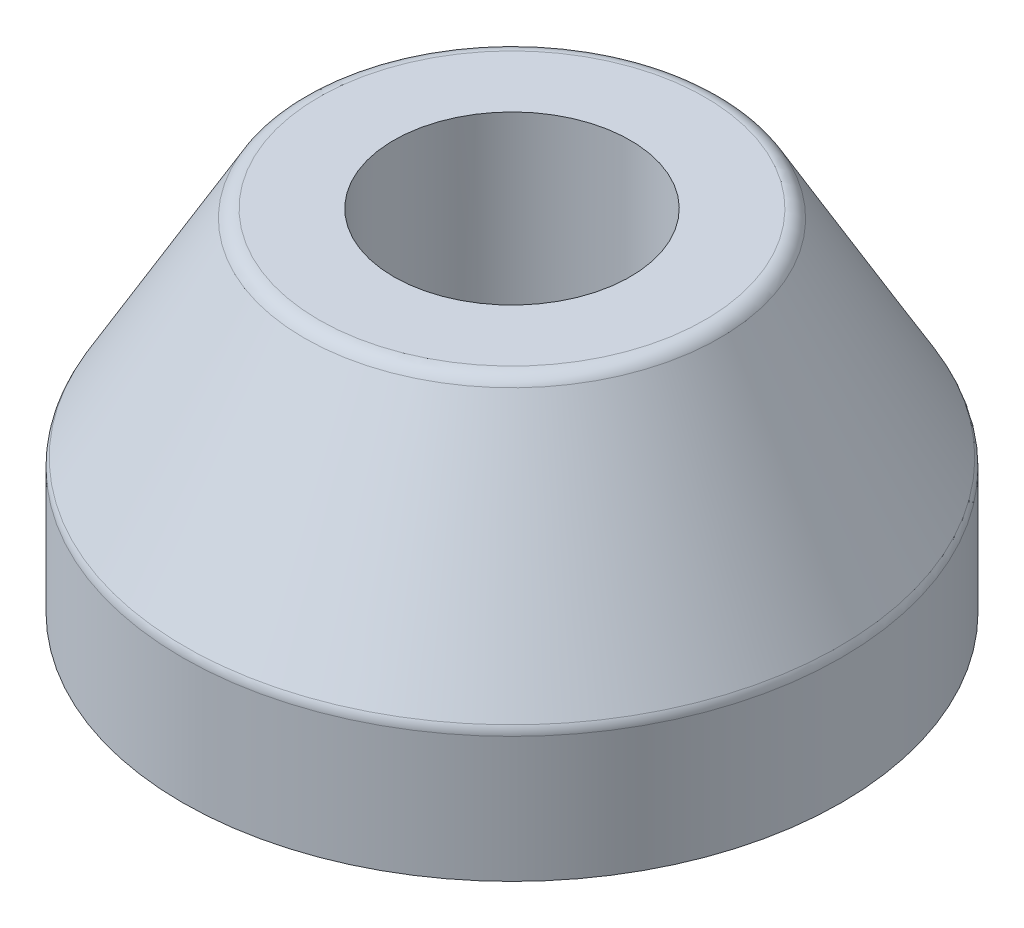
ISO-10303-21;
HEADER;
FILE_DESCRIPTION(('STEP AP214'),'2;1');
FILE_NAME('part.step','',(''),(''),'','','');
FILE_SCHEMA(('AUTOMOTIVE_DESIGN { 1 0 10303 214 1 1 1 1 }'));
ENDSEC;
DATA;
#1=APPLICATION_CONTEXT('core data for automotive mechanical design processes');
#2=APPLICATION_PROTOCOL_DEFINITION('international standard','automotive_design',2000,#1);
#3=PRODUCT_CONTEXT('',#1,'mechanical');
#4=PRODUCT('Part','Part','',(#3));
#5=PRODUCT_RELATED_PRODUCT_CATEGORY('part','',(#4));
#6=PRODUCT_DEFINITION_FORMATION('','',#4);
#7=PRODUCT_DEFINITION_CONTEXT('part definition',#1,'design');
#8=PRODUCT_DEFINITION('design','',#6,#7);
#9=PRODUCT_DEFINITION_SHAPE('','',#8);
#10=(LENGTH_UNIT() NAMED_UNIT(*) SI_UNIT(.MILLI.,.METRE.));
#11=(NAMED_UNIT(*) PLANE_ANGLE_UNIT() SI_UNIT($,.RADIAN.));
#12=(NAMED_UNIT(*) SI_UNIT($,.STERADIAN.) SOLID_ANGLE_UNIT());
#13=UNCERTAINTY_MEASURE_WITH_UNIT(LENGTH_MEASURE(1.E-05),#10,'distance_accuracy_value','');
#14=(GEOMETRIC_REPRESENTATION_CONTEXT(3) GLOBAL_UNCERTAINTY_ASSIGNED_CONTEXT((#13)) GLOBAL_UNIT_ASSIGNED_CONTEXT((#10,
#11,#12)) REPRESENTATION_CONTEXT('',''));
#15=CARTESIAN_POINT('',(0.,0.,0.));
#16=DIRECTION('',(0.,0.,1.));
#17=DIRECTION('',(1.,0.,0.));
#18=AXIS2_PLACEMENT_3D('',#15,#16,#17);
#19=CARTESIAN_POINT('',(-0.166148693522661,-0.374874441964296,0.));
#20=DIRECTION('',(0.,-1.,0.));
#21=DIRECTION('',(0.,0.,-1.));
#22=AXIS2_PLACEMENT_3D('',#19,#20,#21);
#23=CYLINDRICAL_SURFACE('',#22,19.5);
#24=CARTESIAN_POINT('',(-0.166148693522661,-0.642651911271445,0.));
#25=DIRECTION('',(0.,-1.,0.));
#26=DIRECTION('',(0.,0.,-1.));
#27=AXIS2_PLACEMENT_3D('',#24,#25,#26);
#28=CIRCLE('',#27,19.5);
#29=CARTESIAN_POINT('',(-0.166148693522661,-0.642651911271445,-19.5));
#30=VERTEX_POINT('',#29);
#31=EDGE_CURVE('E9',#30,#30,#28,.T.);
#32=ORIENTED_EDGE('',*,*,#31,.T.);
#33=EDGE_LOOP('',(#32));
#34=FACE_BOUND('',#33,.T.);
#35=CARTESIAN_POINT('',(-0.166148693522661,-8.0748744419643,0.));
#36=DIRECTION('',(0.,1.,0.));
#37=DIRECTION('',(0.,0.,1.));
#38=AXIS2_PLACEMENT_3D('',#35,#36,#37);
#39=CIRCLE('',#38,19.5);
#40=CARTESIAN_POINT('',(-0.166148693522661,-8.0748744419643,19.5));
#41=VERTEX_POINT('',#40);
#42=EDGE_CURVE('E34',#41,#41,#39,.T.);
#43=ORIENTED_EDGE('',*,*,#42,.T.);
#44=EDGE_LOOP('',(#43));
#45=FACE_BOUND('',#44,.T.);
#46=ADVANCED_FACE('F14',(#34,#45),#23,.T.);
#47=CARTESIAN_POINT('',(-0.166148693522661,-8.0748744419643,0.));
#48=DIRECTION('',(0.,1.,0.));
#49=DIRECTION('',(0.,0.,1.));
#50=AXIS2_PLACEMENT_3D('',#47,#48,#49);
#51=PLANE('',#50);
#52=ORIENTED_EDGE('',*,*,#42,.F.);
#53=EDGE_LOOP('',(#52));
#54=FACE_BOUND('',#53,.T.);
#55=ADVANCED_FACE('F56',(#54),#51,.F.);
#56=CARTESIAN_POINT('',(-0.166148693522661,12.6251255580357,0.));
#57=DIRECTION('',(0.,1.,0.));
#58=DIRECTION('',(0.,0.,1.));
#59=AXIS2_PLACEMENT_3D('',#56,#57,#58);
#60=PLANE('',#59);
#61=CARTESIAN_POINT('',(-0.166148693522661,12.6251255580357,0.));
#62=DIRECTION('',(0.,1.,0.));
#63=DIRECTION('',(0.,0.,1.));
#64=AXIS2_PLACEMENT_3D('',#61,#62,#63);
#65=CIRCLE('',#64,11.4224360753997);
#66=CARTESIAN_POINT('',(-0.166148693522661,12.6251255580357,11.4224360753997));
#67=VERTEX_POINT('',#66);
#68=EDGE_CURVE('E29',#67,#67,#65,.T.);
#69=ORIENTED_EDGE('',*,*,#68,.T.);
#70=EDGE_LOOP('',(#69));
#71=FACE_BOUND('',#70,.T.);
#72=CARTESIAN_POINT('',(-0.166148693522661,12.6251255580357,0.));
#73=DIRECTION('',(0.,1.,0.));
#74=DIRECTION('',(0.,0.,1.));
#75=AXIS2_PLACEMENT_3D('',#72,#73,#74);
#76=CIRCLE('',#75,7.);
#77=CARTESIAN_POINT('',(-0.166148693522661,12.6251255580357,7.));
#78=VERTEX_POINT('',#77);
#79=EDGE_CURVE('E37',#78,#78,#76,.T.);
#80=ORIENTED_EDGE('',*,*,#79,.F.);
#81=EDGE_LOOP('',(#80));
#82=FACE_BOUND('',#81,.T.);
#83=ADVANCED_FACE('F53',(#71,#82),#60,.T.);
#84=CARTESIAN_POINT('',(-0.166148693522661,12.6251255580357,0.));
#85=DIRECTION('',(0.,-1.,0.));
#86=DIRECTION('',(0.,0.,-1.));
#87=AXIS2_PLACEMENT_3D('',#84,#85,#86);
#88=CONICAL_SURFACE('',#87,12.,0.523278322131975);
#89=CARTESIAN_POINT('',(-0.166148693522661,12.1248480115253,0.));
#90=DIRECTION('',(0.,1.,0.));
#91=DIRECTION('',(0.,0.,1.));
#92=AXIS2_PLACEMENT_3D('',#89,#90,#91);
#93=CIRCLE('',#92,12.2886216614483);
#94=CARTESIAN_POINT('',(-0.166148693522661,12.1248480115253,12.2886216614483));
#95=VERTEX_POINT('',#94);
#96=EDGE_CURVE('E21',#95,#95,#93,.F.);
#97=ORIENTED_EDGE('',*,*,#96,.T.);
#98=EDGE_LOOP('',(#97));
#99=FACE_BOUND('',#98,.T.);
#100=CARTESIAN_POINT('',(-0.166148693522661,-0.142929457781864,0.));
#101=DIRECTION('',(0.,-1.,0.));
#102=DIRECTION('',(0.,0.,-1.));
#103=AXIS2_PLACEMENT_3D('',#100,#101,#102);
#104=CIRCLE('',#103,19.3661855860486);
#105=CARTESIAN_POINT('',(-0.166148693522661,-0.142929457781864,-19.3661855860486));
#106=VERTEX_POINT('',#105);
#107=EDGE_CURVE('E25',#106,#106,#104,.F.);
#108=ORIENTED_EDGE('',*,*,#107,.T.);
#109=EDGE_LOOP('',(#108));
#110=FACE_BOUND('',#109,.T.);
#111=ADVANCED_FACE('F55',(#99,#110),#88,.T.);
#112=CARTESIAN_POINT('',(-0.166148693522658,2.6251255580357,0.));
#113=DIRECTION('',(0.,1.,0.));
#114=DIRECTION('',(-1.,0.,0.));
#115=AXIS2_PLACEMENT_3D('',#112,#113,#114);
#116=SPHERICAL_SURFACE('',#115,7.);
#117=CARTESIAN_POINT('',(-0.166148693522661,2.62512555803571,0.));
#118=DIRECTION('',(0.,1.,0.));
#119=DIRECTION('',(0.,0.,1.));
#120=AXIS2_PLACEMENT_3D('',#117,#118,#119);
#121=CIRCLE('',#120,7.);
#122=CARTESIAN_POINT('',(-0.166148693522661,2.62512555803571,7.));
#123=VERTEX_POINT('',#122);
#124=EDGE_CURVE('E40',#123,#123,#121,.T.);
#125=ORIENTED_EDGE('',*,*,#124,.T.);
#126=EDGE_LOOP('',(#125));
#127=FACE_BOUND('',#126,.T.);
#128=ADVANCED_FACE('F44',(#127),#116,.F.);
#129=CARTESIAN_POINT('',(-0.166148693522661,20.5237246180718,0.));
#130=DIRECTION('',(0.,1.,0.));
#131=DIRECTION('',(0.,0.,1.));
#132=AXIS2_PLACEMENT_3D('',#129,#130,#131);
#133=CYLINDRICAL_SURFACE('',#132,7.);
#134=ORIENTED_EDGE('',*,*,#124,.F.);
#135=EDGE_LOOP('',(#134));
#136=FACE_BOUND('',#135,.T.);
#137=ORIENTED_EDGE('',*,*,#79,.T.);
#138=EDGE_LOOP('',(#137));
#139=FACE_BOUND('',#138,.T.);
#140=ADVANCED_FACE('F46',(#136,#139),#133,.F.);
#141=CARTESIAN_POINT('',(-0.166148693522661,11.6251255580357,0.));
#142=DIRECTION('',(0.,1.,0.));
#143=DIRECTION('',(0.,0.,1.));
#144=AXIS2_PLACEMENT_3D('',#141,#142,#143);
#145=TOROIDAL_SURFACE('',#144,11.4224360753997,1.);
#146=ORIENTED_EDGE('',*,*,#96,.F.);
#147=EDGE_LOOP('',(#146));
#148=FACE_BOUND('',#147,.T.);
#149=ORIENTED_EDGE('',*,*,#68,.F.);
#150=EDGE_LOOP('',(#149));
#151=FACE_BOUND('',#150,.T.);
#152=ADVANCED_FACE('F49',(#148,#151),#145,.T.);
#153=CARTESIAN_POINT('',(-0.166148693522661,-0.642651911271445,0.));
#154=DIRECTION('',(0.,-1.,0.));
#155=DIRECTION('',(0.,0.,-1.));
#156=AXIS2_PLACEMENT_3D('',#153,#154,#155);
#157=TOROIDAL_SURFACE('',#156,18.5,1.);
#158=ORIENTED_EDGE('',*,*,#31,.F.);
#159=EDGE_LOOP('',(#158));
#160=FACE_BOUND('',#159,.T.);
#161=ORIENTED_EDGE('',*,*,#107,.F.);
#162=EDGE_LOOP('',(#161));
#163=FACE_BOUND('',#162,.T.);
#164=ADVANCED_FACE('F16',(#160,#163),#157,.T.);
#165=CLOSED_SHELL('',(#46,#55,#83,#111,#128,#140,#152,#164));
#166=MANIFOLD_SOLID_BREP('B1',#165);
#167=ADVANCED_BREP_SHAPE_REPRESENTATION('',(#18,#166),#14);
#168=SHAPE_DEFINITION_REPRESENTATION(#9,#167);
ENDSEC;
END-ISO-10303-21;
